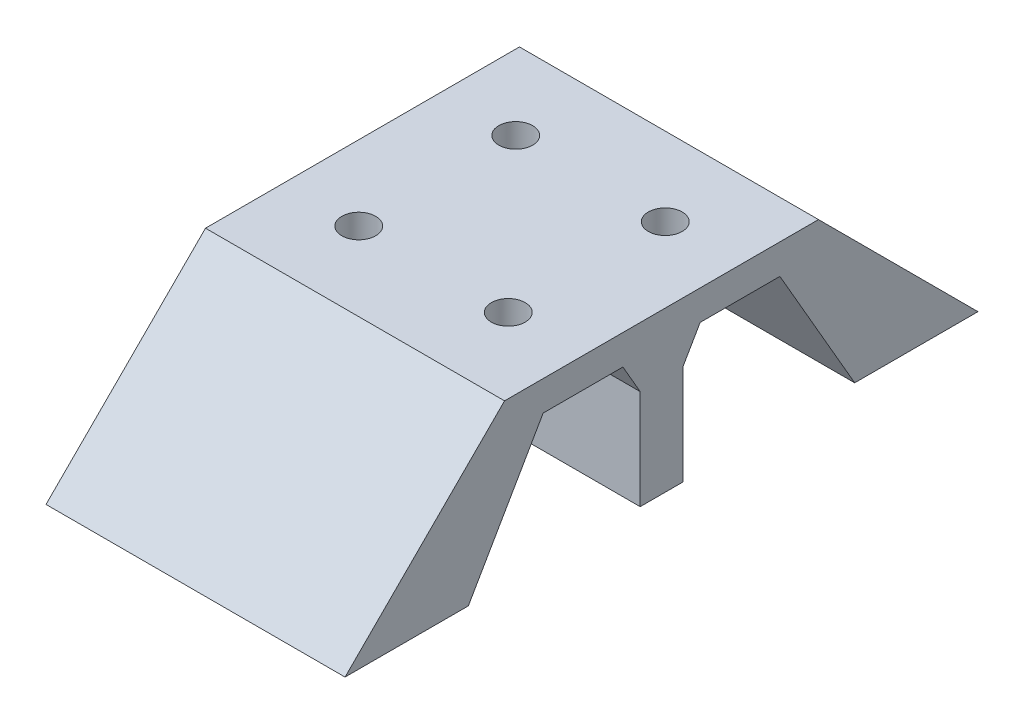
ISO-10303-21;
HEADER;
FILE_DESCRIPTION(('STEP AP214'),'2;1');
FILE_NAME('part.step','',(''),(''),'','','');
FILE_SCHEMA(('AUTOMOTIVE_DESIGN { 1 0 10303 214 1 1 1 1 }'));
ENDSEC;
DATA;
#1=APPLICATION_CONTEXT('core data for automotive mechanical design processes');
#2=APPLICATION_PROTOCOL_DEFINITION('international standard','automotive_design',2000,#1);
#3=PRODUCT_CONTEXT('',#1,'mechanical');
#4=PRODUCT('Part','Part','',(#3));
#5=PRODUCT_RELATED_PRODUCT_CATEGORY('part','',(#4));
#6=PRODUCT_DEFINITION_FORMATION('','',#4);
#7=PRODUCT_DEFINITION_CONTEXT('part definition',#1,'design');
#8=PRODUCT_DEFINITION('design','',#6,#7);
#9=PRODUCT_DEFINITION_SHAPE('','',#8);
#10=(LENGTH_UNIT() NAMED_UNIT(*) SI_UNIT(.MILLI.,.METRE.));
#11=(NAMED_UNIT(*) PLANE_ANGLE_UNIT() SI_UNIT($,.RADIAN.));
#12=(NAMED_UNIT(*) SI_UNIT($,.STERADIAN.) SOLID_ANGLE_UNIT());
#13=UNCERTAINTY_MEASURE_WITH_UNIT(LENGTH_MEASURE(1.E-05),#10,'distance_accuracy_value','');
#14=(GEOMETRIC_REPRESENTATION_CONTEXT(3) GLOBAL_UNCERTAINTY_ASSIGNED_CONTEXT((#13)) GLOBAL_UNIT_ASSIGNED_CONTEXT((#10,
#11,#12)) REPRESENTATION_CONTEXT('',''));
#15=CARTESIAN_POINT('',(0.,0.,0.));
#16=DIRECTION('',(0.,0.,1.));
#17=DIRECTION('',(1.,0.,0.));
#18=AXIS2_PLACEMENT_3D('',#15,#16,#17);
#19=CARTESIAN_POINT('',(38.1,10.9525,10.9524999999999));
#20=DIRECTION('',(0.,-0.707106781186551,-0.707106781186544));
#21=DIRECTION('',(0.,0.707106781186544,-0.707106781186551));
#22=AXIS2_PLACEMENT_3D('',#19,#20,#21);
#23=PLANE('',#22);
#24=DIRECTION('',(0.,-0.707106781186544,0.707106781186551));
#25=VECTOR('',#24,1.);
#26=CARTESIAN_POINT('',(0.,10.9525,10.9524999999999));
#27=LINE('',#26,#25);
#28=CARTESIAN_POINT('',(0.,1.905,20.));
#29=VERTEX_POINT('',#28);
#30=CARTESIAN_POINT('',(0.,-18.415,40.3200000000002));
#31=VERTEX_POINT('',#30);
#32=EDGE_CURVE('E176',#29,#31,#27,.T.);
#33=ORIENTED_EDGE('',*,*,#32,.T.);
#34=DIRECTION('',(-1.,0.,0.));
#35=VECTOR('',#34,1.);
#36=CARTESIAN_POINT('',(38.1,-18.415,40.3200000000002));
#37=LINE('',#36,#35);
#38=CARTESIAN_POINT('',(38.1,-18.415,40.3200000000002));
#39=VERTEX_POINT('',#38);
#40=EDGE_CURVE('E236',#39,#31,#37,.T.);
#41=ORIENTED_EDGE('',*,*,#40,.F.);
#42=DIRECTION('',(0.,-0.707106781186544,0.707106781186551));
#43=VECTOR('',#42,1.);
#44=CARTESIAN_POINT('',(38.1,10.9525,10.9524999999999));
#45=LINE('',#44,#43);
#46=CARTESIAN_POINT('',(38.1,1.905,20.));
#47=VERTEX_POINT('',#46);
#48=EDGE_CURVE('E214',#47,#39,#45,.T.);
#49=ORIENTED_EDGE('',*,*,#48,.F.);
#50=DIRECTION('',(-1.,0.,0.));
#51=VECTOR('',#50,1.);
#52=CARTESIAN_POINT('',(38.1,1.905,20.));
#53=LINE('',#52,#51);
#54=EDGE_CURVE('E172',#47,#29,#53,.T.);
#55=ORIENTED_EDGE('',*,*,#54,.T.);
#56=EDGE_LOOP('',(#33,#41,#49,#55));
#57=FACE_BOUND('',#56,.T.);
#58=ADVANCED_FACE('F42',(#57),#23,.F.);
#59=CARTESIAN_POINT('',(38.1,-18.415,0.));
#60=DIRECTION('',(0.,1.,0.));
#61=DIRECTION('',(0.,0.,1.));
#62=AXIS2_PLACEMENT_3D('',#59,#60,#61);
#63=PLANE('',#62);
#64=DIRECTION('',(0.,0.,-1.));
#65=VECTOR('',#64,1.);
#66=CARTESIAN_POINT('',(0.,-18.415,0.));
#67=LINE('',#66,#65);
#68=CARTESIAN_POINT('',(0.,-18.415,24.6120529443208));
#69=VERTEX_POINT('',#68);
#70=EDGE_CURVE('E179',#31,#69,#67,.T.);
#71=ORIENTED_EDGE('',*,*,#70,.T.);
#72=DIRECTION('',(-1.,0.,0.));
#73=VECTOR('',#72,1.);
#74=CARTESIAN_POINT('',(38.1,-18.415,24.6120529443208));
#75=LINE('',#74,#73);
#76=CARTESIAN_POINT('',(38.1,-18.415,24.6120529443208));
#77=VERTEX_POINT('',#76);
#78=EDGE_CURVE('E234',#77,#69,#75,.T.);
#79=ORIENTED_EDGE('',*,*,#78,.F.);
#80=DIRECTION('',(0.,0.,-1.));
#81=VECTOR('',#80,1.);
#82=CARTESIAN_POINT('',(38.1,-18.415,0.));
#83=LINE('',#82,#81);
#84=EDGE_CURVE('E118',#39,#77,#83,.T.);
#85=ORIENTED_EDGE('',*,*,#84,.F.);
#86=ORIENTED_EDGE('',*,*,#40,.T.);
#87=EDGE_LOOP('',(#71,#79,#85,#86));
#88=FACE_BOUND('',#87,.T.);
#89=ADVANCED_FACE('F342',(#88),#63,.F.);
#90=CARTESIAN_POINT('',(38.1,6.05358154453468,10.4851108028952));
#91=DIRECTION('',(0.,-0.500000000000004,-0.866025403784436));
#92=DIRECTION('',(0.,0.866025403784436,-0.500000000000004));
#93=AXIS2_PLACEMENT_3D('',#90,#91,#92);
#94=PLANE('',#93);
#95=DIRECTION('',(0.,-0.866025403784436,0.500000000000004));
#96=VECTOR('',#95,1.);
#97=CARTESIAN_POINT('',(0.,6.05358154453468,10.4851108028952));
#98=LINE('',#97,#96);
#99=CARTESIAN_POINT('',(0.,-1.905,15.08));
#100=VERTEX_POINT('',#99);
#101=EDGE_CURVE('E183',#100,#69,#98,.T.);
#102=ORIENTED_EDGE('',*,*,#101,.F.);
#103=DIRECTION('',(-1.,0.,0.));
#104=VECTOR('',#103,1.);
#105=CARTESIAN_POINT('',(38.1,-1.905,15.08));
#106=LINE('',#105,#104);
#107=CARTESIAN_POINT('',(38.1,-1.905,15.08));
#108=VERTEX_POINT('',#107);
#109=EDGE_CURVE('E232',#108,#100,#106,.T.);
#110=ORIENTED_EDGE('',*,*,#109,.F.);
#111=DIRECTION('',(0.,-0.866025403784436,0.500000000000004));
#112=VECTOR('',#111,1.);
#113=CARTESIAN_POINT('',(38.1,6.05358154453468,10.4851108028952));
#114=LINE('',#113,#112);
#115=EDGE_CURVE('E297',#108,#77,#114,.T.);
#116=ORIENTED_EDGE('',*,*,#115,.T.);
#117=ORIENTED_EDGE('',*,*,#78,.T.);
#118=EDGE_LOOP('',(#102,#110,#116,#117));
#119=FACE_BOUND('',#118,.T.);
#120=ADVANCED_FACE('F347',(#119),#94,.T.);
#121=CARTESIAN_POINT('',(38.1,-1.905,0.));
#122=DIRECTION('',(0.,1.,0.));
#123=DIRECTION('',(0.,0.,1.));
#124=AXIS2_PLACEMENT_3D('',#121,#122,#123);
#125=PLANE('',#124);
#126=CARTESIAN_POINT('',(9.525,-1.905,9.99999999999998));
#127=DIRECTION('',(0.,1.,0.));
#128=DIRECTION('',(0.,0.,1.));
#129=AXIS2_PLACEMENT_3D('',#126,#127,#128);
#130=CIRCLE('',#129,3.21475100000003);
#131=CARTESIAN_POINT('',(9.525,-1.905,13.214751));
#132=VERTEX_POINT('',#131);
#133=EDGE_CURVE('E259',#132,#132,#130,.T.);
#134=ORIENTED_EDGE('',*,*,#133,.T.);
#135=EDGE_LOOP('',(#134));
#136=FACE_BOUND('',#135,.T.);
#137=CARTESIAN_POINT('',(28.575,-1.905,9.99999999999998));
#138=DIRECTION('',(0.,1.,0.));
#139=DIRECTION('',(0.,0.,1.));
#140=AXIS2_PLACEMENT_3D('',#137,#138,#139);
#141=CIRCLE('',#140,3.21475100000003);
#142=CARTESIAN_POINT('',(28.575,-1.905,13.214751));
#143=VERTEX_POINT('',#142);
#144=EDGE_CURVE('E256',#143,#143,#141,.T.);
#145=ORIENTED_EDGE('',*,*,#144,.T.);
#146=EDGE_LOOP('',(#145));
#147=FACE_BOUND('',#146,.T.);
#148=DIRECTION('',(0.,0.,-1.));
#149=VECTOR('',#148,1.);
#150=CARTESIAN_POINT('',(0.,-1.905,0.));
#151=LINE('',#150,#149);
#152=CARTESIAN_POINT('',(0.,-1.905,4.91999999999998));
#153=VERTEX_POINT('',#152);
#154=EDGE_CURVE('E186',#100,#153,#151,.T.);
#155=ORIENTED_EDGE('',*,*,#154,.T.);
#156=DIRECTION('',(-1.,0.,0.));
#157=VECTOR('',#156,1.);
#158=CARTESIAN_POINT('',(38.1,-1.905,4.91999999999998));
#159=LINE('',#158,#157);
#160=CARTESIAN_POINT('',(38.1,-1.905,4.91999999999998));
#161=VERTEX_POINT('',#160);
#162=EDGE_CURVE('E230',#161,#153,#159,.T.);
#163=ORIENTED_EDGE('',*,*,#162,.F.);
#164=DIRECTION('',(0.,0.,-1.));
#165=VECTOR('',#164,1.);
#166=CARTESIAN_POINT('',(38.1,-1.905,0.));
#167=LINE('',#166,#165);
#168=EDGE_CURVE('E300',#108,#161,#167,.T.);
#169=ORIENTED_EDGE('',*,*,#168,.F.);
#170=ORIENTED_EDGE('',*,*,#109,.T.);
#171=EDGE_LOOP('',(#155,#163,#169,#170));
#172=FACE_BOUND('',#171,.T.);
#173=ADVANCED_FACE('F457',(#136,#147,#172),#125,.F.);
#174=CARTESIAN_POINT('',(38.1,-2.60667249330973,4.51488919710465));
#175=DIRECTION('',(0.,-0.500000000000004,0.866025403784436));
#176=DIRECTION('',(0.,-0.866025403784436,-0.500000000000004));
#177=AXIS2_PLACEMENT_3D('',#174,#175,#176);
#178=PLANE('',#177);
#179=DIRECTION('',(0.,0.866025403784436,0.500000000000004));
#180=VECTOR('',#179,1.);
#181=CARTESIAN_POINT('',(0.,-2.60667249330973,4.51488919710465));
#182=LINE('',#181,#180);
#183=CARTESIAN_POINT('',(0.,-5.715,2.72029547438749));
#184=VERTEX_POINT('',#183);
#185=EDGE_CURVE('E189',#184,#153,#182,.T.);
#186=ORIENTED_EDGE('',*,*,#185,.F.);
#187=DIRECTION('',(-1.,0.,0.));
#188=VECTOR('',#187,1.);
#189=CARTESIAN_POINT('',(38.1,-5.715,2.72029547438749));
#190=LINE('',#189,#188);
#191=CARTESIAN_POINT('',(38.1,-5.715,2.72029547438749));
#192=VERTEX_POINT('',#191);
#193=EDGE_CURVE('E228',#192,#184,#190,.T.);
#194=ORIENTED_EDGE('',*,*,#193,.F.);
#195=DIRECTION('',(0.,0.866025403784436,0.500000000000004));
#196=VECTOR('',#195,1.);
#197=CARTESIAN_POINT('',(38.1,-2.60667249330973,4.51488919710465));
#198=LINE('',#197,#196);
#199=EDGE_CURVE('E302',#192,#161,#198,.T.);
#200=ORIENTED_EDGE('',*,*,#199,.T.);
#201=ORIENTED_EDGE('',*,*,#162,.T.);
#202=EDGE_LOOP('',(#186,#194,#200,#201));
#203=FACE_BOUND('',#202,.T.);
#204=ADVANCED_FACE('F453',(#203),#178,.T.);
#205=CARTESIAN_POINT('',(38.1,0.,2.72029547438749));
#206=DIRECTION('',(0.,0.,1.));
#207=DIRECTION('',(1.,0.,0.));
#208=AXIS2_PLACEMENT_3D('',#205,#206,#207);
#209=PLANE('',#208);
#210=DIRECTION('',(0.,1.,0.));
#211=VECTOR('',#210,1.);
#212=CARTESIAN_POINT('',(0.,0.,2.72029547438749));
#213=LINE('',#212,#211);
#214=CARTESIAN_POINT('',(0.,-18.415,2.72029547438749));
#215=VERTEX_POINT('',#214);
#216=EDGE_CURVE('E192',#215,#184,#213,.T.);
#217=ORIENTED_EDGE('',*,*,#216,.F.);
#218=DIRECTION('',(-1.,0.,0.));
#219=VECTOR('',#218,1.);
#220=CARTESIAN_POINT('',(38.1,-18.415,2.72029547438749));
#221=LINE('',#220,#219);
#222=CARTESIAN_POINT('',(38.1,-18.415,2.72029547438749));
#223=VERTEX_POINT('',#222);
#224=EDGE_CURVE('E226',#223,#215,#221,.T.);
#225=ORIENTED_EDGE('',*,*,#224,.F.);
#226=DIRECTION('',(0.,1.,0.));
#227=VECTOR('',#226,1.);
#228=CARTESIAN_POINT('',(38.1,0.,2.72029547438749));
#229=LINE('',#228,#227);
#230=EDGE_CURVE('E305',#223,#192,#229,.T.);
#231=ORIENTED_EDGE('',*,*,#230,.T.);
#232=ORIENTED_EDGE('',*,*,#193,.T.);
#233=EDGE_LOOP('',(#217,#225,#231,#232));
#234=FACE_BOUND('',#233,.T.);
#235=ADVANCED_FACE('F449',(#234),#209,.T.);
#236=CARTESIAN_POINT('',(38.1,-18.415,0.));
#237=DIRECTION('',(0.,-1.,0.));
#238=DIRECTION('',(0.,0.,-1.));
#239=AXIS2_PLACEMENT_3D('',#236,#237,#238);
#240=PLANE('',#239);
#241=DIRECTION('',(0.,0.,1.));
#242=VECTOR('',#241,1.);
#243=CARTESIAN_POINT('',(0.,-18.415,0.));
#244=LINE('',#243,#242);
#245=CARTESIAN_POINT('',(0.,-18.415,-2.72029547438749));
#246=VERTEX_POINT('',#245);
#247=EDGE_CURVE('E195',#246,#215,#244,.T.);
#248=ORIENTED_EDGE('',*,*,#247,.F.);
#249=DIRECTION('',(-1.,0.,0.));
#250=VECTOR('',#249,1.);
#251=CARTESIAN_POINT('',(38.1,-18.415,-2.72029547438749));
#252=LINE('',#251,#250);
#253=CARTESIAN_POINT('',(38.1,-18.415,-2.72029547438749));
#254=VERTEX_POINT('',#253);
#255=EDGE_CURVE('E224',#254,#246,#252,.T.);
#256=ORIENTED_EDGE('',*,*,#255,.F.);
#257=DIRECTION('',(0.,0.,1.));
#258=VECTOR('',#257,1.);
#259=CARTESIAN_POINT('',(38.1,-18.415,0.));
#260=LINE('',#259,#258);
#261=EDGE_CURVE('E308',#254,#223,#260,.T.);
#262=ORIENTED_EDGE('',*,*,#261,.T.);
#263=ORIENTED_EDGE('',*,*,#224,.T.);
#264=EDGE_LOOP('',(#248,#256,#262,#263));
#265=FACE_BOUND('',#264,.T.);
#266=ADVANCED_FACE('F444',(#265),#240,.T.);
#267=CARTESIAN_POINT('',(38.1,0.,-2.72029547438748));
#268=DIRECTION('',(0.,0.,-1.));
#269=DIRECTION('',(0.,1.,0.));
#270=AXIS2_PLACEMENT_3D('',#267,#268,#269);
#271=PLANE('',#270);
#272=DIRECTION('',(0.,-1.,0.));
#273=VECTOR('',#272,1.);
#274=CARTESIAN_POINT('',(0.,0.,-2.72029547438748));
#275=LINE('',#274,#273);
#276=CARTESIAN_POINT('',(0.,-5.715,-2.72029547438748));
#277=VERTEX_POINT('',#276);
#278=EDGE_CURVE('E198',#277,#246,#275,.T.);
#279=ORIENTED_EDGE('',*,*,#278,.F.);
#280=DIRECTION('',(-1.,0.,0.));
#281=VECTOR('',#280,1.);
#282=CARTESIAN_POINT('',(38.1,-5.715,-2.72029547438748));
#283=LINE('',#282,#281);
#284=CARTESIAN_POINT('',(38.1,-5.715,-2.72029547438748));
#285=VERTEX_POINT('',#284);
#286=EDGE_CURVE('E222',#285,#277,#283,.T.);
#287=ORIENTED_EDGE('',*,*,#286,.F.);
#288=DIRECTION('',(0.,-1.,0.));
#289=VECTOR('',#288,1.);
#290=CARTESIAN_POINT('',(38.1,0.,-2.72029547438748));
#291=LINE('',#290,#289);
#292=EDGE_CURVE('E311',#285,#254,#291,.T.);
#293=ORIENTED_EDGE('',*,*,#292,.T.);
#294=ORIENTED_EDGE('',*,*,#255,.T.);
#295=EDGE_LOOP('',(#279,#287,#293,#294));
#296=FACE_BOUND('',#295,.T.);
#297=ADVANCED_FACE('F440',(#296),#271,.T.);
#298=CARTESIAN_POINT('',(38.1,-2.60667249330973,-4.51488919710465));
#299=DIRECTION('',(0.,-0.500000000000004,-0.866025403784436));
#300=DIRECTION('',(0.,0.866025403784436,-0.500000000000004));
#301=AXIS2_PLACEMENT_3D('',#298,#299,#300);
#302=PLANE('',#301);
#303=DIRECTION('',(0.,-0.866025403784436,0.500000000000004));
#304=VECTOR('',#303,1.);
#305=CARTESIAN_POINT('',(0.,-2.60667249330973,-4.51488919710465));
#306=LINE('',#305,#304);
#307=CARTESIAN_POINT('',(0.,-1.905,-4.91999999999998));
#308=VERTEX_POINT('',#307);
#309=EDGE_CURVE('E201',#308,#277,#306,.T.);
#310=ORIENTED_EDGE('',*,*,#309,.F.);
#311=DIRECTION('',(-1.,0.,0.));
#312=VECTOR('',#311,1.);
#313=CARTESIAN_POINT('',(38.1,-1.905,-4.91999999999998));
#314=LINE('',#313,#312);
#315=CARTESIAN_POINT('',(38.1,-1.905,-4.91999999999998));
#316=VERTEX_POINT('',#315);
#317=EDGE_CURVE('E220',#316,#308,#314,.T.);
#318=ORIENTED_EDGE('',*,*,#317,.F.);
#319=DIRECTION('',(0.,-0.866025403784436,0.500000000000004));
#320=VECTOR('',#319,1.);
#321=CARTESIAN_POINT('',(38.1,-2.60667249330973,-4.51488919710465));
#322=LINE('',#321,#320);
#323=EDGE_CURVE('E314',#316,#285,#322,.T.);
#324=ORIENTED_EDGE('',*,*,#323,.T.);
#325=ORIENTED_EDGE('',*,*,#286,.T.);
#326=EDGE_LOOP('',(#310,#318,#324,#325));
#327=FACE_BOUND('',#326,.T.);
#328=ADVANCED_FACE('F432',(#327),#302,.T.);
#329=CARTESIAN_POINT('',(38.1,-1.905,0.));
#330=DIRECTION('',(0.,-1.,0.));
#331=DIRECTION('',(0.,0.,-1.));
#332=AXIS2_PLACEMENT_3D('',#329,#330,#331);
#333=PLANE('',#332);
#334=CARTESIAN_POINT('',(28.575,-1.905,-9.99999999999998));
#335=DIRECTION('',(0.,-1.,0.));
#336=DIRECTION('',(0.,0.,-1.));
#337=AXIS2_PLACEMENT_3D('',#334,#335,#336);
#338=CIRCLE('',#337,3.21475100000003);
#339=CARTESIAN_POINT('',(28.575,-1.905,-13.214751));
#340=VERTEX_POINT('',#339);
#341=EDGE_CURVE('E52',#340,#340,#338,.F.);
#342=ORIENTED_EDGE('',*,*,#341,.T.);
#343=EDGE_LOOP('',(#342));
#344=FACE_BOUND('',#343,.T.);
#345=CARTESIAN_POINT('',(9.525,-1.905,-9.99999999999998));
#346=DIRECTION('',(0.,-1.,0.));
#347=DIRECTION('',(0.,0.,-1.));
#348=AXIS2_PLACEMENT_3D('',#345,#346,#347);
#349=CIRCLE('',#348,3.21475100000003);
#350=CARTESIAN_POINT('',(9.525,-1.905,-13.214751));
#351=VERTEX_POINT('',#350);
#352=EDGE_CURVE('E268',#351,#351,#349,.F.);
#353=ORIENTED_EDGE('',*,*,#352,.T.);
#354=EDGE_LOOP('',(#353));
#355=FACE_BOUND('',#354,.T.);
#356=DIRECTION('',(0.,0.,1.));
#357=VECTOR('',#356,1.);
#358=CARTESIAN_POINT('',(0.,-1.905,0.));
#359=LINE('',#358,#357);
#360=CARTESIAN_POINT('',(0.,-1.905,-15.08));
#361=VERTEX_POINT('',#360);
#362=EDGE_CURVE('E204',#361,#308,#359,.T.);
#363=ORIENTED_EDGE('',*,*,#362,.F.);
#364=DIRECTION('',(-1.,0.,0.));
#365=VECTOR('',#364,1.);
#366=CARTESIAN_POINT('',(38.1,-1.905,-15.08));
#367=LINE('',#366,#365);
#368=CARTESIAN_POINT('',(38.1,-1.905,-15.08));
#369=VERTEX_POINT('',#368);
#370=EDGE_CURVE('E218',#369,#361,#367,.T.);
#371=ORIENTED_EDGE('',*,*,#370,.F.);
#372=DIRECTION('',(0.,0.,1.));
#373=VECTOR('',#372,1.);
#374=CARTESIAN_POINT('',(38.1,-1.905,0.));
#375=LINE('',#374,#373);
#376=EDGE_CURVE('E317',#369,#316,#375,.T.);
#377=ORIENTED_EDGE('',*,*,#376,.T.);
#378=ORIENTED_EDGE('',*,*,#317,.T.);
#379=EDGE_LOOP('',(#363,#371,#377,#378));
#380=FACE_BOUND('',#379,.T.);
#381=ADVANCED_FACE('F273',(#344,#355,#380),#333,.T.);
#382=CARTESIAN_POINT('',(38.1,6.05358154453469,-10.4851108028952));
#383=DIRECTION('',(0.,-0.500000000000004,0.866025403784436));
#384=DIRECTION('',(0.,-0.866025403784436,-0.500000000000005));
#385=AXIS2_PLACEMENT_3D('',#382,#383,#384);
#386=PLANE('',#385);
#387=DIRECTION('',(0.,0.866025403784436,0.500000000000004));
#388=VECTOR('',#387,1.);
#389=CARTESIAN_POINT('',(0.,6.05358154453469,-10.4851108028952));
#390=LINE('',#389,#388);
#391=CARTESIAN_POINT('',(0.,-18.415,-24.6120529443208));
#392=VERTEX_POINT('',#391);
#393=EDGE_CURVE('E207',#392,#361,#390,.T.);
#394=ORIENTED_EDGE('',*,*,#393,.F.);
#395=DIRECTION('',(-1.,0.,0.));
#396=VECTOR('',#395,1.);
#397=CARTESIAN_POINT('',(38.1,-18.415,-24.6120529443208));
#398=LINE('',#397,#396);
#399=CARTESIAN_POINT('',(38.1,-18.415,-24.6120529443208));
#400=VERTEX_POINT('',#399);
#401=EDGE_CURVE('E161',#400,#392,#398,.T.);
#402=ORIENTED_EDGE('',*,*,#401,.F.);
#403=DIRECTION('',(0.,0.866025403784436,0.500000000000004));
#404=VECTOR('',#403,1.);
#405=CARTESIAN_POINT('',(38.1,6.05358154453469,-10.4851108028952));
#406=LINE('',#405,#404);
#407=EDGE_CURVE('E168',#400,#369,#406,.T.);
#408=ORIENTED_EDGE('',*,*,#407,.T.);
#409=ORIENTED_EDGE('',*,*,#370,.T.);
#410=EDGE_LOOP('',(#394,#402,#408,#409));
#411=FACE_BOUND('',#410,.T.);
#412=ADVANCED_FACE('F321',(#411),#386,.T.);
#413=CARTESIAN_POINT('',(38.1,-18.415,0.));
#414=DIRECTION('',(0.,-1.,0.));
#415=DIRECTION('',(0.,0.,-1.));
#416=AXIS2_PLACEMENT_3D('',#413,#414,#415);
#417=PLANE('',#416);
#418=DIRECTION('',(0.,0.,1.));
#419=VECTOR('',#418,1.);
#420=CARTESIAN_POINT('',(0.,-18.415,0.));
#421=LINE('',#420,#419);
#422=CARTESIAN_POINT('',(0.,-18.415,-40.3199999999999));
#423=VERTEX_POINT('',#422);
#424=EDGE_CURVE('E156',#423,#392,#421,.T.);
#425=ORIENTED_EDGE('',*,*,#424,.F.);
#426=DIRECTION('',(-1.,0.,0.));
#427=VECTOR('',#426,1.);
#428=CARTESIAN_POINT('',(38.1,-18.415,-40.3199999999999));
#429=LINE('',#428,#427);
#430=CARTESIAN_POINT('',(38.1,-18.415,-40.3199999999999));
#431=VERTEX_POINT('',#430);
#432=EDGE_CURVE('E151',#431,#423,#429,.T.);
#433=ORIENTED_EDGE('',*,*,#432,.F.);
#434=DIRECTION('',(0.,0.,1.));
#435=VECTOR('',#434,1.);
#436=CARTESIAN_POINT('',(38.1,-18.415,0.));
#437=LINE('',#436,#435);
#438=EDGE_CURVE('E154',#431,#400,#437,.T.);
#439=ORIENTED_EDGE('',*,*,#438,.T.);
#440=ORIENTED_EDGE('',*,*,#401,.T.);
#441=EDGE_LOOP('',(#425,#433,#439,#440));
#442=FACE_BOUND('',#441,.T.);
#443=ADVANCED_FACE('F153',(#442),#417,.T.);
#444=CARTESIAN_POINT('',(38.1,10.9525,-10.9525000000001));
#445=DIRECTION('',(0.,0.707106781186544,-0.707106781186551));
#446=DIRECTION('',(0.,0.707106781186551,0.707106781186544));
#447=AXIS2_PLACEMENT_3D('',#444,#445,#446);
#448=PLANE('',#447);
#449=DIRECTION('',(0.,-0.707106781186551,-0.707106781186544));
#450=VECTOR('',#449,1.);
#451=CARTESIAN_POINT('',(0.,10.9525,-10.9525000000001));
#452=LINE('',#451,#450);
#453=CARTESIAN_POINT('',(0.,1.905,-20.));
#454=VERTEX_POINT('',#453);
#455=EDGE_CURVE('E211',#454,#423,#452,.T.);
#456=ORIENTED_EDGE('',*,*,#455,.F.);
#457=DIRECTION('',(-1.,0.,0.));
#458=VECTOR('',#457,1.);
#459=CARTESIAN_POINT('',(38.1,1.905,-20.));
#460=LINE('',#459,#458);
#461=CARTESIAN_POINT('',(38.1,1.905,-20.));
#462=VERTEX_POINT('',#461);
#463=EDGE_CURVE('E106',#462,#454,#460,.T.);
#464=ORIENTED_EDGE('',*,*,#463,.F.);
#465=DIRECTION('',(0.,-0.707106781186551,-0.707106781186544));
#466=VECTOR('',#465,1.);
#467=CARTESIAN_POINT('',(38.1,10.9525,-10.9525000000001));
#468=LINE('',#467,#466);
#469=EDGE_CURVE('E165',#462,#431,#468,.T.);
#470=ORIENTED_EDGE('',*,*,#469,.T.);
#471=ORIENTED_EDGE('',*,*,#432,.T.);
#472=EDGE_LOOP('',(#456,#464,#470,#471));
#473=FACE_BOUND('',#472,.T.);
#474=ADVANCED_FACE('F170',(#473),#448,.T.);
#475=CARTESIAN_POINT('',(38.1,1.905,0.));
#476=DIRECTION('',(0.,-1.,0.));
#477=DIRECTION('',(0.,0.,-1.));
#478=AXIS2_PLACEMENT_3D('',#475,#476,#477);
#479=PLANE('',#478);
#480=CARTESIAN_POINT('',(9.525,1.905,-9.99999999999998));
#481=DIRECTION('',(0.,-1.,0.));
#482=DIRECTION('',(0.,0.,-1.));
#483=AXIS2_PLACEMENT_3D('',#480,#481,#482);
#484=CIRCLE('',#483,2.15702401148297);
#485=CARTESIAN_POINT('',(9.525,1.905,-12.157024011483));
#486=VERTEX_POINT('',#485);
#487=EDGE_CURVE('E250',#486,#486,#484,.T.);
#488=ORIENTED_EDGE('',*,*,#487,.T.);
#489=EDGE_LOOP('',(#488));
#490=FACE_BOUND('',#489,.T.);
#491=CARTESIAN_POINT('',(9.525,1.905,9.99999999999998));
#492=DIRECTION('',(0.,-1.,0.));
#493=DIRECTION('',(0.,0.,-1.));
#494=AXIS2_PLACEMENT_3D('',#491,#492,#493);
#495=CIRCLE('',#494,2.15702401148297);
#496=CARTESIAN_POINT('',(9.525,1.905,7.84297598851701));
#497=VERTEX_POINT('',#496);
#498=EDGE_CURVE('E246',#497,#497,#495,.T.);
#499=ORIENTED_EDGE('',*,*,#498,.T.);
#500=EDGE_LOOP('',(#499));
#501=FACE_BOUND('',#500,.T.);
#502=CARTESIAN_POINT('',(28.575,1.905,9.99999999999998));
#503=DIRECTION('',(0.,-1.,0.));
#504=DIRECTION('',(0.,0.,-1.));
#505=AXIS2_PLACEMENT_3D('',#502,#503,#504);
#506=CIRCLE('',#505,2.15702401148297);
#507=CARTESIAN_POINT('',(28.575,1.905,7.84297598851701));
#508=VERTEX_POINT('',#507);
#509=EDGE_CURVE('E242',#508,#508,#506,.T.);
#510=ORIENTED_EDGE('',*,*,#509,.T.);
#511=EDGE_LOOP('',(#510));
#512=FACE_BOUND('',#511,.T.);
#513=CARTESIAN_POINT('',(28.575,1.905,-9.99999999999998));
#514=DIRECTION('',(0.,-1.,0.));
#515=DIRECTION('',(0.,0.,-1.));
#516=AXIS2_PLACEMENT_3D('',#513,#514,#515);
#517=CIRCLE('',#516,2.15702401148296);
#518=CARTESIAN_POINT('',(28.575,1.905,-12.1570240114829));
#519=VERTEX_POINT('',#518);
#520=EDGE_CURVE('E180',#519,#519,#517,.T.);
#521=ORIENTED_EDGE('',*,*,#520,.T.);
#522=EDGE_LOOP('',(#521));
#523=FACE_BOUND('',#522,.T.);
#524=DIRECTION('',(0.,0.,1.));
#525=VECTOR('',#524,1.);
#526=CARTESIAN_POINT('',(0.,1.905,0.));
#527=LINE('',#526,#525);
#528=EDGE_CURVE('E109',#454,#29,#527,.T.);
#529=ORIENTED_EDGE('',*,*,#528,.T.);
#530=ORIENTED_EDGE('',*,*,#54,.F.);
#531=DIRECTION('',(0.,0.,1.));
#532=VECTOR('',#531,1.);
#533=CARTESIAN_POINT('',(38.1,1.905,0.));
#534=LINE('',#533,#532);
#535=EDGE_CURVE('E60',#462,#47,#534,.T.);
#536=ORIENTED_EDGE('',*,*,#535,.F.);
#537=ORIENTED_EDGE('',*,*,#463,.T.);
#538=EDGE_LOOP('',(#529,#530,#536,#537));
#539=FACE_BOUND('',#538,.T.);
#540=ADVANCED_FACE('F329',(#490,#501,#512,#523,#539),#479,.F.);
#541=CARTESIAN_POINT('',(38.1,0.,0.));
#542=DIRECTION('',(1.,0.,0.));
#543=DIRECTION('',(0.,0.,-1.));
#544=AXIS2_PLACEMENT_3D('',#541,#542,#543);
#545=PLANE('',#544);
#546=ORIENTED_EDGE('',*,*,#48,.T.);
#547=ORIENTED_EDGE('',*,*,#84,.T.);
#548=ORIENTED_EDGE('',*,*,#115,.F.);
#549=ORIENTED_EDGE('',*,*,#168,.T.);
#550=ORIENTED_EDGE('',*,*,#199,.F.);
#551=ORIENTED_EDGE('',*,*,#230,.F.);
#552=ORIENTED_EDGE('',*,*,#261,.F.);
#553=ORIENTED_EDGE('',*,*,#292,.F.);
#554=ORIENTED_EDGE('',*,*,#323,.F.);
#555=ORIENTED_EDGE('',*,*,#376,.F.);
#556=ORIENTED_EDGE('',*,*,#407,.F.);
#557=ORIENTED_EDGE('',*,*,#438,.F.);
#558=ORIENTED_EDGE('',*,*,#469,.F.);
#559=ORIENTED_EDGE('',*,*,#535,.T.);
#560=EDGE_LOOP('',(#546,#547,#548,#549,#550,#551,#552,#553,#554,#555,#556,#557,#558,#559));
#561=FACE_BOUND('',#560,.T.);
#562=ADVANCED_FACE('F164',(#561),#545,.T.);
#563=CARTESIAN_POINT('',(0.,0.,0.));
#564=DIRECTION('',(1.,0.,0.));
#565=DIRECTION('',(0.,0.,-1.));
#566=AXIS2_PLACEMENT_3D('',#563,#564,#565);
#567=PLANE('',#566);
#568=ORIENTED_EDGE('',*,*,#32,.F.);
#569=ORIENTED_EDGE('',*,*,#528,.F.);
#570=ORIENTED_EDGE('',*,*,#455,.T.);
#571=ORIENTED_EDGE('',*,*,#424,.T.);
#572=ORIENTED_EDGE('',*,*,#393,.T.);
#573=ORIENTED_EDGE('',*,*,#362,.T.);
#574=ORIENTED_EDGE('',*,*,#309,.T.);
#575=ORIENTED_EDGE('',*,*,#278,.T.);
#576=ORIENTED_EDGE('',*,*,#247,.T.);
#577=ORIENTED_EDGE('',*,*,#216,.T.);
#578=ORIENTED_EDGE('',*,*,#185,.T.);
#579=ORIENTED_EDGE('',*,*,#154,.F.);
#580=ORIENTED_EDGE('',*,*,#101,.T.);
#581=ORIENTED_EDGE('',*,*,#70,.F.);
#582=EDGE_LOOP('',(#568,#569,#570,#571,#572,#573,#574,#575,#576,#577,#578,#579,#580,#581));
#583=FACE_BOUND('',#582,.T.);
#584=ADVANCED_FACE('F325',(#583),#567,.F.);
#585=CARTESIAN_POINT('',(28.575,1.651,-9.99999999999998));
#586=DIRECTION('',(0.,-1.,0.));
#587=DIRECTION('',(0.,0.,-1.));
#588=AXIS2_PLACEMENT_3D('',#585,#586,#587);
#589=CONICAL_SURFACE('',#588,2.579751,1.02974425867665);
#590=CARTESIAN_POINT('',(28.575,1.651,-9.99999999999998));
#591=DIRECTION('',(0.,-1.,0.));
#592=DIRECTION('',(0.,0.,-1.));
#593=AXIS2_PLACEMENT_3D('',#590,#591,#592);
#594=CIRCLE('',#593,2.579751);
#595=CARTESIAN_POINT('',(28.575,1.651,-12.579751));
#596=VERTEX_POINT('',#595);
#597=EDGE_CURVE('E241',#596,#596,#594,.T.);
#598=ORIENTED_EDGE('',*,*,#597,.T.);
#599=EDGE_LOOP('',(#598));
#600=FACE_BOUND('',#599,.T.);
#601=ORIENTED_EDGE('',*,*,#520,.F.);
#602=EDGE_LOOP('',(#601));
#603=FACE_BOUND('',#602,.T.);
#604=ADVANCED_FACE('F286',(#600,#603),#589,.F.);
#605=CARTESIAN_POINT('',(28.575,-1.905,-9.99999999999998));
#606=DIRECTION('',(0.,-1.,0.));
#607=DIRECTION('',(0.,0.,-1.));
#608=AXIS2_PLACEMENT_3D('',#605,#606,#607);
#609=CYLINDRICAL_SURFACE('',#608,2.579751);
#610=CARTESIAN_POINT('',(28.575,-1.53838257906458,-9.99999999999998));
#611=DIRECTION('',(0.,-1.,0.));
#612=DIRECTION('',(0.,0.,-1.));
#613=AXIS2_PLACEMENT_3D('',#610,#611,#612);
#614=CIRCLE('',#613,2.579751);
#615=CARTESIAN_POINT('',(28.575,-1.53838257906458,-12.579751));
#616=VERTEX_POINT('',#615);
#617=EDGE_CURVE('E265',#616,#616,#614,.T.);
#618=ORIENTED_EDGE('',*,*,#617,.T.);
#619=EDGE_LOOP('',(#618));
#620=FACE_BOUND('',#619,.T.);
#621=ORIENTED_EDGE('',*,*,#597,.F.);
#622=EDGE_LOOP('',(#621));
#623=FACE_BOUND('',#622,.T.);
#624=ADVANCED_FACE('F282',(#620,#623),#609,.F.);
#625=CARTESIAN_POINT('',(28.575,1.651,9.99999999999998));
#626=DIRECTION('',(0.,-1.,0.));
#627=DIRECTION('',(0.,0.,-1.));
#628=AXIS2_PLACEMENT_3D('',#625,#626,#627);
#629=CONICAL_SURFACE('',#628,2.579751,1.02974425867665);
#630=CARTESIAN_POINT('',(28.575,1.651,9.99999999999998));
#631=DIRECTION('',(0.,-1.,0.));
#632=DIRECTION('',(0.,0.,-1.));
#633=AXIS2_PLACEMENT_3D('',#630,#631,#632);
#634=CIRCLE('',#633,2.579751);
#635=CARTESIAN_POINT('',(28.575,1.651,7.42024899999998));
#636=VERTEX_POINT('',#635);
#637=EDGE_CURVE('E245',#636,#636,#634,.T.);
#638=ORIENTED_EDGE('',*,*,#637,.T.);
#639=EDGE_LOOP('',(#638));
#640=FACE_BOUND('',#639,.T.);
#641=ORIENTED_EDGE('',*,*,#509,.F.);
#642=EDGE_LOOP('',(#641));
#643=FACE_BOUND('',#642,.T.);
#644=ADVANCED_FACE('F285',(#640,#643),#629,.F.);
#645=CARTESIAN_POINT('',(28.575,-1.905,9.99999999999998));
#646=DIRECTION('',(0.,-1.,0.));
#647=DIRECTION('',(0.,0.,-1.));
#648=AXIS2_PLACEMENT_3D('',#645,#646,#647);
#649=CYLINDRICAL_SURFACE('',#648,2.579751);
#650=CARTESIAN_POINT('',(28.575,-1.53838257906458,9.99999999999998));
#651=DIRECTION('',(0.,1.,0.));
#652=DIRECTION('',(0.,0.,1.));
#653=AXIS2_PLACEMENT_3D('',#650,#651,#652);
#654=CIRCLE('',#653,2.579751);
#655=CARTESIAN_POINT('',(28.575,-1.53838257906458,12.579751));
#656=VERTEX_POINT('',#655);
#657=EDGE_CURVE('E262',#656,#656,#654,.F.);
#658=ORIENTED_EDGE('',*,*,#657,.T.);
#659=EDGE_LOOP('',(#658));
#660=FACE_BOUND('',#659,.T.);
#661=ORIENTED_EDGE('',*,*,#637,.F.);
#662=EDGE_LOOP('',(#661));
#663=FACE_BOUND('',#662,.T.);
#664=ADVANCED_FACE('F375',(#660,#663),#649,.F.);
#665=CARTESIAN_POINT('',(9.525,1.651,9.99999999999998));
#666=DIRECTION('',(0.,-1.,0.));
#667=DIRECTION('',(0.,0.,-1.));
#668=AXIS2_PLACEMENT_3D('',#665,#666,#667);
#669=CONICAL_SURFACE('',#668,2.579751,1.02974425867665);
#670=CARTESIAN_POINT('',(9.525,1.651,9.99999999999998));
#671=DIRECTION('',(0.,-1.,0.));
#672=DIRECTION('',(0.,0.,-1.));
#673=AXIS2_PLACEMENT_3D('',#670,#671,#672);
#674=CIRCLE('',#673,2.579751);
#675=CARTESIAN_POINT('',(9.525,1.651,7.42024899999998));
#676=VERTEX_POINT('',#675);
#677=EDGE_CURVE('E249',#676,#676,#674,.T.);
#678=ORIENTED_EDGE('',*,*,#677,.T.);
#679=EDGE_LOOP('',(#678));
#680=FACE_BOUND('',#679,.T.);
#681=ORIENTED_EDGE('',*,*,#498,.F.);
#682=EDGE_LOOP('',(#681));
#683=FACE_BOUND('',#682,.T.);
#684=ADVANCED_FACE('F378',(#680,#683),#669,.F.);
#685=CARTESIAN_POINT('',(9.525,-1.905,9.99999999999998));
#686=DIRECTION('',(0.,-1.,0.));
#687=DIRECTION('',(0.,0.,-1.));
#688=AXIS2_PLACEMENT_3D('',#685,#686,#687);
#689=CYLINDRICAL_SURFACE('',#688,2.579751);
#690=CARTESIAN_POINT('',(9.525,-1.53838257906458,9.99999999999998));
#691=DIRECTION('',(0.,1.,0.));
#692=DIRECTION('',(0.,0.,1.));
#693=AXIS2_PLACEMENT_3D('',#690,#691,#692);
#694=CIRCLE('',#693,2.579751);
#695=CARTESIAN_POINT('',(9.525,-1.53838257906458,12.579751));
#696=VERTEX_POINT('',#695);
#697=EDGE_CURVE('E238',#696,#696,#694,.F.);
#698=ORIENTED_EDGE('',*,*,#697,.T.);
#699=EDGE_LOOP('',(#698));
#700=FACE_BOUND('',#699,.T.);
#701=ORIENTED_EDGE('',*,*,#677,.F.);
#702=EDGE_LOOP('',(#701));
#703=FACE_BOUND('',#702,.T.);
#704=ADVANCED_FACE('F399',(#700,#703),#689,.F.);
#705=CARTESIAN_POINT('',(9.525,1.651,-9.99999999999998));
#706=DIRECTION('',(0.,-1.,0.));
#707=DIRECTION('',(0.,0.,-1.));
#708=AXIS2_PLACEMENT_3D('',#705,#706,#707);
#709=CONICAL_SURFACE('',#708,2.579751,1.02974425867665);
#710=CARTESIAN_POINT('',(9.525,1.651,-9.99999999999998));
#711=DIRECTION('',(0.,-1.,0.));
#712=DIRECTION('',(0.,0.,-1.));
#713=AXIS2_PLACEMENT_3D('',#710,#711,#712);
#714=CIRCLE('',#713,2.579751);
#715=CARTESIAN_POINT('',(9.525,1.651,-12.579751));
#716=VERTEX_POINT('',#715);
#717=EDGE_CURVE('E253',#716,#716,#714,.T.);
#718=ORIENTED_EDGE('',*,*,#717,.T.);
#719=EDGE_LOOP('',(#718));
#720=FACE_BOUND('',#719,.T.);
#721=ORIENTED_EDGE('',*,*,#487,.F.);
#722=EDGE_LOOP('',(#721));
#723=FACE_BOUND('',#722,.T.);
#724=ADVANCED_FACE('F403',(#720,#723),#709,.F.);
#725=CARTESIAN_POINT('',(9.525,-1.905,-9.99999999999998));
#726=DIRECTION('',(0.,-1.,0.));
#727=DIRECTION('',(0.,0.,-1.));
#728=AXIS2_PLACEMENT_3D('',#725,#726,#727);
#729=CYLINDRICAL_SURFACE('',#728,2.579751);
#730=CARTESIAN_POINT('',(9.525,-1.53838257906458,-9.99999999999998));
#731=DIRECTION('',(0.,-1.,0.));
#732=DIRECTION('',(0.,0.,-1.));
#733=AXIS2_PLACEMENT_3D('',#730,#731,#732);
#734=CIRCLE('',#733,2.579751);
#735=CARTESIAN_POINT('',(9.525,-1.53838257906458,-12.579751));
#736=VERTEX_POINT('',#735);
#737=EDGE_CURVE('E11',#736,#736,#734,.T.);
#738=ORIENTED_EDGE('',*,*,#737,.T.);
#739=EDGE_LOOP('',(#738));
#740=FACE_BOUND('',#739,.T.);
#741=ORIENTED_EDGE('',*,*,#717,.F.);
#742=EDGE_LOOP('',(#741));
#743=FACE_BOUND('',#742,.T.);
#744=ADVANCED_FACE('F358',(#740,#743),#729,.F.);
#745=CARTESIAN_POINT('',(9.525,-1.53838257906458,9.99999999999998));
#746=DIRECTION('',(0.,-1.,0.));
#747=DIRECTION('',(0.,0.,-1.));
#748=AXIS2_PLACEMENT_3D('',#745,#746,#747);
#749=CONICAL_SURFACE('',#748,2.579751,1.0471975511966);
#750=ORIENTED_EDGE('',*,*,#133,.F.);
#751=EDGE_LOOP('',(#750));
#752=FACE_BOUND('',#751,.T.);
#753=ORIENTED_EDGE('',*,*,#697,.F.);
#754=EDGE_LOOP('',(#753));
#755=FACE_BOUND('',#754,.T.);
#756=ADVANCED_FACE('F352',(#752,#755),#749,.F.);
#757=CARTESIAN_POINT('',(28.575,-1.53838257906458,9.99999999999998));
#758=DIRECTION('',(0.,-1.,0.));
#759=DIRECTION('',(0.,0.,-1.));
#760=AXIS2_PLACEMENT_3D('',#757,#758,#759);
#761=CONICAL_SURFACE('',#760,2.579751,1.0471975511966);
#762=ORIENTED_EDGE('',*,*,#144,.F.);
#763=EDGE_LOOP('',(#762));
#764=FACE_BOUND('',#763,.T.);
#765=ORIENTED_EDGE('',*,*,#657,.F.);
#766=EDGE_LOOP('',(#765));
#767=FACE_BOUND('',#766,.T.);
#768=ADVANCED_FACE('F279',(#764,#767),#761,.F.);
#769=CARTESIAN_POINT('',(28.575,-1.53838257906458,-9.99999999999998));
#770=DIRECTION('',(0.,-1.,0.));
#771=DIRECTION('',(0.,0.,-1.));
#772=AXIS2_PLACEMENT_3D('',#769,#770,#771);
#773=CONICAL_SURFACE('',#772,2.579751,1.0471975511966);
#774=ORIENTED_EDGE('',*,*,#341,.F.);
#775=EDGE_LOOP('',(#774));
#776=FACE_BOUND('',#775,.T.);
#777=ORIENTED_EDGE('',*,*,#617,.F.);
#778=EDGE_LOOP('',(#777));
#779=FACE_BOUND('',#778,.T.);
#780=ADVANCED_FACE('F276',(#776,#779),#773,.F.);
#781=CARTESIAN_POINT('',(9.525,-1.53838257906458,-9.99999999999998));
#782=DIRECTION('',(0.,-1.,0.));
#783=DIRECTION('',(0.,0.,-1.));
#784=AXIS2_PLACEMENT_3D('',#781,#782,#783);
#785=CONICAL_SURFACE('',#784,2.579751,1.0471975511966);
#786=ORIENTED_EDGE('',*,*,#352,.F.);
#787=EDGE_LOOP('',(#786));
#788=FACE_BOUND('',#787,.T.);
#789=ORIENTED_EDGE('',*,*,#737,.F.);
#790=EDGE_LOOP('',(#789));
#791=FACE_BOUND('',#790,.T.);
#792=ADVANCED_FACE('F45',(#788,#791),#785,.F.);
#793=CLOSED_SHELL('',(#58,#89,#120,#173,#204,#235,#266,#297,#328,#381,#412,#443,#474,#540,#562,
#584,#604,#624,#644,#664,#684,#704,#724,#744,#756,#768,#780,#792));
#794=MANIFOLD_SOLID_BREP('B2',#793);
#795=ADVANCED_BREP_SHAPE_REPRESENTATION('',(#18,#794),#14);
#796=SHAPE_DEFINITION_REPRESENTATION(#9,#795);
ENDSEC;
END-ISO-10303-21;
